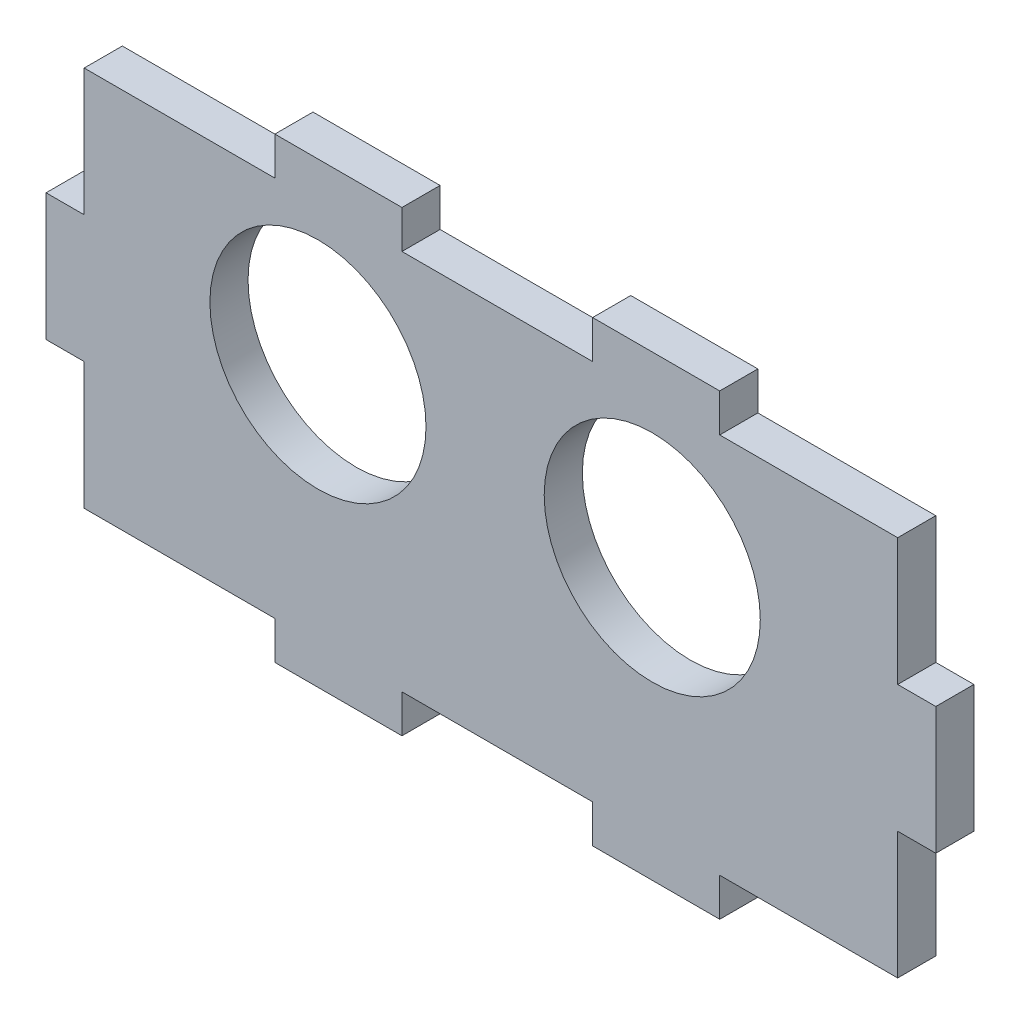
ISO-10303-21;
HEADER;
FILE_DESCRIPTION(('STEP AP214'),'2;1');
FILE_NAME('part.step','',(''),(''),'','','');
FILE_SCHEMA(('AUTOMOTIVE_DESIGN { 1 0 10303 214 1 1 1 1 }'));
ENDSEC;
DATA;
#1=APPLICATION_CONTEXT('core data for automotive mechanical design processes');
#2=APPLICATION_PROTOCOL_DEFINITION('international standard','automotive_design',2000,#1);
#3=PRODUCT_CONTEXT('',#1,'mechanical');
#4=PRODUCT('Part','Part','',(#3));
#5=PRODUCT_RELATED_PRODUCT_CATEGORY('part','',(#4));
#6=PRODUCT_DEFINITION_FORMATION('','',#4);
#7=PRODUCT_DEFINITION_CONTEXT('part definition',#1,'design');
#8=PRODUCT_DEFINITION('design','',#6,#7);
#9=PRODUCT_DEFINITION_SHAPE('','',#8);
#10=(LENGTH_UNIT() NAMED_UNIT(*) SI_UNIT(.MILLI.,.METRE.));
#11=(NAMED_UNIT(*) PLANE_ANGLE_UNIT() SI_UNIT($,.RADIAN.));
#12=(NAMED_UNIT(*) SI_UNIT($,.STERADIAN.) SOLID_ANGLE_UNIT());
#13=UNCERTAINTY_MEASURE_WITH_UNIT(LENGTH_MEASURE(1.E-05),#10,'distance_accuracy_value','');
#14=(GEOMETRIC_REPRESENTATION_CONTEXT(3) GLOBAL_UNCERTAINTY_ASSIGNED_CONTEXT((#13)) GLOBAL_UNIT_ASSIGNED_CONTEXT((#10,
#11,#12)) REPRESENTATION_CONTEXT('',''));
#15=CARTESIAN_POINT('',(0.,0.,0.));
#16=DIRECTION('',(0.,0.,1.));
#17=DIRECTION('',(1.,0.,0.));
#18=AXIS2_PLACEMENT_3D('',#15,#16,#17);
#19=CARTESIAN_POINT('',(0.,0.,3.));
#20=DIRECTION('',(0.,0.,-1.));
#21=DIRECTION('',(-1.,0.,0.));
#22=AXIS2_PLACEMENT_3D('',#19,#20,#21);
#23=PLANE('',#22);
#24=DIRECTION('',(0.,1.,0.));
#25=VECTOR('',#24,1.);
#26=CARTESIAN_POINT('',(11.0987610930498,-30.,3.));
#27=LINE('',#26,#25);
#28=CARTESIAN_POINT('',(11.0987610930498,-33.,3.));
#29=VERTEX_POINT('',#28);
#30=CARTESIAN_POINT('',(11.0987610930498,-30.,3.));
#31=VERTEX_POINT('',#30);
#32=EDGE_CURVE('E305',#29,#31,#27,.T.);
#33=ORIENTED_EDGE('',*,*,#32,.T.);
#34=DIRECTION('',(1.,0.,0.));
#35=VECTOR('',#34,1.);
#36=CARTESIAN_POINT('',(25.0987610930498,-30.,3.));
#37=LINE('',#36,#35);
#38=CARTESIAN_POINT('',(25.0987610930498,-30.,3.));
#39=VERTEX_POINT('',#38);
#40=EDGE_CURVE('E153',#31,#39,#37,.T.);
#41=ORIENTED_EDGE('',*,*,#40,.T.);
#42=DIRECTION('',(0.,1.,0.));
#43=VECTOR('',#42,1.);
#44=CARTESIAN_POINT('',(25.0987610930498,-20.,3.));
#45=LINE('',#44,#43);
#46=CARTESIAN_POINT('',(25.0987610930498,-20.,3.));
#47=VERTEX_POINT('',#46);
#48=EDGE_CURVE('E380',#39,#47,#45,.T.);
#49=ORIENTED_EDGE('',*,*,#48,.T.);
#50=DIRECTION('',(1.,0.,0.));
#51=VECTOR('',#50,1.);
#52=CARTESIAN_POINT('',(28.0987610930498,-20.,3.));
#53=LINE('',#52,#51);
#54=CARTESIAN_POINT('',(28.0987610930498,-20.,3.));
#55=VERTEX_POINT('',#54);
#56=EDGE_CURVE('E399',#47,#55,#53,.T.);
#57=ORIENTED_EDGE('',*,*,#56,.T.);
#58=DIRECTION('',(0.,1.,0.));
#59=VECTOR('',#58,1.);
#60=CARTESIAN_POINT('',(28.0987610930498,-10.,3.));
#61=LINE('',#60,#59);
#62=CARTESIAN_POINT('',(28.0987610930498,-10.,3.));
#63=VERTEX_POINT('',#62);
#64=EDGE_CURVE('E396',#55,#63,#61,.T.);
#65=ORIENTED_EDGE('',*,*,#64,.T.);
#66=DIRECTION('',(-1.,0.,0.));
#67=VECTOR('',#66,1.);
#68=CARTESIAN_POINT('',(25.0987610930498,-10.,3.));
#69=LINE('',#68,#67);
#70=CARTESIAN_POINT('',(25.0987610930498,-10.,3.));
#71=VERTEX_POINT('',#70);
#72=EDGE_CURVE('E398',#63,#71,#69,.T.);
#73=ORIENTED_EDGE('',*,*,#72,.T.);
#74=DIRECTION('',(0.,1.,0.));
#75=VECTOR('',#74,1.);
#76=CARTESIAN_POINT('',(25.0987610930498,0.,3.));
#77=LINE('',#76,#75);
#78=CARTESIAN_POINT('',(25.0987610930498,0.,3.));
#79=VERTEX_POINT('',#78);
#80=EDGE_CURVE('E401',#71,#79,#77,.T.);
#81=ORIENTED_EDGE('',*,*,#80,.T.);
#82=DIRECTION('',(-1.,0.,0.));
#83=VECTOR('',#82,1.);
#84=CARTESIAN_POINT('',(11.0987610930498,0.,3.));
#85=LINE('',#84,#83);
#86=CARTESIAN_POINT('',(11.0987610930498,0.,3.));
#87=VERTEX_POINT('',#86);
#88=EDGE_CURVE('E407',#79,#87,#85,.T.);
#89=ORIENTED_EDGE('',*,*,#88,.T.);
#90=DIRECTION('',(0.,1.,0.));
#91=VECTOR('',#90,1.);
#92=CARTESIAN_POINT('',(11.0987610930498,3.,3.));
#93=LINE('',#92,#91);
#94=CARTESIAN_POINT('',(11.0987610930498,3.,3.));
#95=VERTEX_POINT('',#94);
#96=EDGE_CURVE('E409',#87,#95,#93,.T.);
#97=ORIENTED_EDGE('',*,*,#96,.T.);
#98=DIRECTION('',(-1.,0.,0.));
#99=VECTOR('',#98,1.);
#100=CARTESIAN_POINT('',(1.09876109304978,3.,3.));
#101=LINE('',#100,#99);
#102=CARTESIAN_POINT('',(1.09876109304978,3.,3.));
#103=VERTEX_POINT('',#102);
#104=EDGE_CURVE('E411',#95,#103,#101,.T.);
#105=ORIENTED_EDGE('',*,*,#104,.T.);
#106=DIRECTION('',(0.,-1.,0.));
#107=VECTOR('',#106,1.);
#108=CARTESIAN_POINT('',(1.09876109304978,0.,3.));
#109=LINE('',#108,#107);
#110=CARTESIAN_POINT('',(1.09876109304978,0.,3.));
#111=VERTEX_POINT('',#110);
#112=EDGE_CURVE('E413',#103,#111,#109,.T.);
#113=ORIENTED_EDGE('',*,*,#112,.T.);
#114=DIRECTION('',(-1.,0.,0.));
#115=VECTOR('',#114,1.);
#116=CARTESIAN_POINT('',(-13.9012389069502,0.,3.));
#117=LINE('',#116,#115);
#118=CARTESIAN_POINT('',(-13.9012389069502,0.,3.));
#119=VERTEX_POINT('',#118);
#120=EDGE_CURVE('E415',#111,#119,#117,.T.);
#121=ORIENTED_EDGE('',*,*,#120,.T.);
#122=DIRECTION('',(0.,1.,0.));
#123=VECTOR('',#122,1.);
#124=CARTESIAN_POINT('',(-13.9012389069502,3.,3.));
#125=LINE('',#124,#123);
#126=CARTESIAN_POINT('',(-13.9012389069502,3.,3.));
#127=VERTEX_POINT('',#126);
#128=EDGE_CURVE('E417',#119,#127,#125,.T.);
#129=ORIENTED_EDGE('',*,*,#128,.T.);
#130=DIRECTION('',(-1.,0.,0.));
#131=VECTOR('',#130,1.);
#132=CARTESIAN_POINT('',(-23.9012389069502,3.,3.));
#133=LINE('',#132,#131);
#134=CARTESIAN_POINT('',(-23.9012389069502,3.,3.));
#135=VERTEX_POINT('',#134);
#136=EDGE_CURVE('E419',#127,#135,#133,.T.);
#137=ORIENTED_EDGE('',*,*,#136,.T.);
#138=DIRECTION('',(0.,-1.,0.));
#139=VECTOR('',#138,1.);
#140=CARTESIAN_POINT('',(-23.9012389069502,0.,3.));
#141=LINE('',#140,#139);
#142=CARTESIAN_POINT('',(-23.9012389069502,0.,3.));
#143=VERTEX_POINT('',#142);
#144=EDGE_CURVE('E421',#135,#143,#141,.T.);
#145=ORIENTED_EDGE('',*,*,#144,.T.);
#146=DIRECTION('',(-1.,0.,0.));
#147=VECTOR('',#146,1.);
#148=CARTESIAN_POINT('',(-38.9012389069502,0.,3.));
#149=LINE('',#148,#147);
#150=CARTESIAN_POINT('',(-38.9012389069502,0.,3.));
#151=VERTEX_POINT('',#150);
#152=EDGE_CURVE('E423',#143,#151,#149,.T.);
#153=ORIENTED_EDGE('',*,*,#152,.T.);
#154=DIRECTION('',(0.,-1.,0.));
#155=VECTOR('',#154,1.);
#156=CARTESIAN_POINT('',(-38.9012389069502,0.,3.));
#157=LINE('',#156,#155);
#158=CARTESIAN_POINT('',(-38.9012389069502,-10.,3.));
#159=VERTEX_POINT('',#158);
#160=EDGE_CURVE('E425',#151,#159,#157,.T.);
#161=ORIENTED_EDGE('',*,*,#160,.T.);
#162=DIRECTION('',(-1.,0.,0.));
#163=VECTOR('',#162,1.);
#164=CARTESIAN_POINT('',(-38.9012389069502,-10.,3.));
#165=LINE('',#164,#163);
#166=CARTESIAN_POINT('',(-41.9012389069502,-10.,3.));
#167=VERTEX_POINT('',#166);
#168=EDGE_CURVE('E427',#159,#167,#165,.T.);
#169=ORIENTED_EDGE('',*,*,#168,.T.);
#170=DIRECTION('',(0.,-1.,0.));
#171=VECTOR('',#170,1.);
#172=CARTESIAN_POINT('',(-41.9012389069502,-10.,3.));
#173=LINE('',#172,#171);
#174=CARTESIAN_POINT('',(-41.9012389069502,-20.,3.));
#175=VERTEX_POINT('',#174);
#176=EDGE_CURVE('E429',#167,#175,#173,.T.);
#177=ORIENTED_EDGE('',*,*,#176,.T.);
#178=DIRECTION('',(1.,0.,0.));
#179=VECTOR('',#178,1.);
#180=CARTESIAN_POINT('',(-41.9012389069502,-20.,3.));
#181=LINE('',#180,#179);
#182=CARTESIAN_POINT('',(-38.9012389069502,-20.,3.));
#183=VERTEX_POINT('',#182);
#184=EDGE_CURVE('E431',#175,#183,#181,.T.);
#185=ORIENTED_EDGE('',*,*,#184,.T.);
#186=DIRECTION('',(0.,-1.,0.));
#187=VECTOR('',#186,1.);
#188=CARTESIAN_POINT('',(-38.9012389069502,-20.,3.));
#189=LINE('',#188,#187);
#190=CARTESIAN_POINT('',(-38.9012389069502,-30.,3.));
#191=VERTEX_POINT('',#190);
#192=EDGE_CURVE('E433',#183,#191,#189,.T.);
#193=ORIENTED_EDGE('',*,*,#192,.T.);
#194=DIRECTION('',(1.,0.,0.));
#195=VECTOR('',#194,1.);
#196=CARTESIAN_POINT('',(-23.9012389069502,-30.,3.));
#197=LINE('',#196,#195);
#198=CARTESIAN_POINT('',(-23.9012389069502,-30.,3.));
#199=VERTEX_POINT('',#198);
#200=EDGE_CURVE('E435',#191,#199,#197,.T.);
#201=ORIENTED_EDGE('',*,*,#200,.T.);
#202=DIRECTION('',(0.,-1.,0.));
#203=VECTOR('',#202,1.);
#204=CARTESIAN_POINT('',(-23.9012389069502,-33.,3.));
#205=LINE('',#204,#203);
#206=CARTESIAN_POINT('',(-23.9012389069502,-33.,3.));
#207=VERTEX_POINT('',#206);
#208=EDGE_CURVE('E437',#199,#207,#205,.T.);
#209=ORIENTED_EDGE('',*,*,#208,.T.);
#210=DIRECTION('',(1.,0.,0.));
#211=VECTOR('',#210,1.);
#212=CARTESIAN_POINT('',(-13.9012389069502,-33.,3.));
#213=LINE('',#212,#211);
#214=CARTESIAN_POINT('',(-13.9012389069502,-33.,3.));
#215=VERTEX_POINT('',#214);
#216=EDGE_CURVE('E439',#207,#215,#213,.T.);
#217=ORIENTED_EDGE('',*,*,#216,.T.);
#218=DIRECTION('',(0.,1.,0.));
#219=VECTOR('',#218,1.);
#220=CARTESIAN_POINT('',(-13.9012389069502,-30.,3.));
#221=LINE('',#220,#219);
#222=CARTESIAN_POINT('',(-13.9012389069502,-30.,3.));
#223=VERTEX_POINT('',#222);
#224=EDGE_CURVE('E232',#215,#223,#221,.T.);
#225=ORIENTED_EDGE('',*,*,#224,.T.);
#226=DIRECTION('',(1.,0.,0.));
#227=VECTOR('',#226,1.);
#228=CARTESIAN_POINT('',(1.0987610930498,-30.,3.));
#229=LINE('',#228,#227);
#230=CARTESIAN_POINT('',(1.0987610930498,-30.,3.));
#231=VERTEX_POINT('',#230);
#232=EDGE_CURVE('E226',#223,#231,#229,.T.);
#233=ORIENTED_EDGE('',*,*,#232,.T.);
#234=DIRECTION('',(0.,-1.,0.));
#235=VECTOR('',#234,1.);
#236=CARTESIAN_POINT('',(1.0987610930498,-33.,3.));
#237=LINE('',#236,#235);
#238=CARTESIAN_POINT('',(1.0987610930498,-33.,3.));
#239=VERTEX_POINT('',#238);
#240=EDGE_CURVE('E230',#231,#239,#237,.T.);
#241=ORIENTED_EDGE('',*,*,#240,.T.);
#242=DIRECTION('',(1.,0.,0.));
#243=VECTOR('',#242,1.);
#244=CARTESIAN_POINT('',(11.0987610930498,-33.,3.));
#245=LINE('',#244,#243);
#246=EDGE_CURVE('E50',#239,#29,#245,.T.);
#247=ORIENTED_EDGE('',*,*,#246,.T.);
#248=EDGE_LOOP('',(#33,#41,#49,#57,#65,#73,#81,#89,#97,#105,#113,#121,#129,#137,#145,#153,#161,
#169,#177,#185,#193,#201,#209,#217,#225,#233,#241,#247));
#249=FACE_BOUND('',#248,.T.);
#250=CARTESIAN_POINT('',(-20.510522939361,-11.,3.));
#251=DIRECTION('',(0.,0.,1.));
#252=DIRECTION('',(1.,0.,0.));
#253=AXIS2_PLACEMENT_3D('',#250,#251,#252);
#254=CIRCLE('',#253,8.5);
#255=CARTESIAN_POINT('',(-12.010522939361,-11.,3.));
#256=VERTEX_POINT('',#255);
#257=EDGE_CURVE('E254',#256,#256,#254,.T.);
#258=ORIENTED_EDGE('',*,*,#257,.F.);
#259=EDGE_LOOP('',(#258));
#260=FACE_BOUND('',#259,.T.);
#261=CARTESIAN_POINT('',(5.78947706063905,-11.,3.));
#262=DIRECTION('',(0.,0.,1.));
#263=DIRECTION('',(1.,0.,0.));
#264=AXIS2_PLACEMENT_3D('',#261,#262,#263);
#265=CIRCLE('',#264,8.5);
#266=CARTESIAN_POINT('',(14.289477060639,-11.,3.));
#267=VERTEX_POINT('',#266);
#268=EDGE_CURVE('E480',#267,#267,#265,.T.);
#269=ORIENTED_EDGE('',*,*,#268,.F.);
#270=EDGE_LOOP('',(#269));
#271=FACE_BOUND('',#270,.T.);
#272=ADVANCED_FACE('F33',(#249,#260,#271),#23,.F.);
#273=CARTESIAN_POINT('',(0.,0.,0.));
#274=DIRECTION('',(0.,0.,-1.));
#275=DIRECTION('',(-1.,0.,0.));
#276=AXIS2_PLACEMENT_3D('',#273,#274,#275);
#277=PLANE('',#276);
#278=CARTESIAN_POINT('',(-20.510522939361,-11.,0.));
#279=DIRECTION('',(0.,0.,1.));
#280=DIRECTION('',(1.,0.,0.));
#281=AXIS2_PLACEMENT_3D('',#278,#279,#280);
#282=CIRCLE('',#281,8.5);
#283=CARTESIAN_POINT('',(-12.010522939361,-11.,0.));
#284=VERTEX_POINT('',#283);
#285=EDGE_CURVE('E485',#284,#284,#282,.T.);
#286=ORIENTED_EDGE('',*,*,#285,.T.);
#287=EDGE_LOOP('',(#286));
#288=FACE_BOUND('',#287,.T.);
#289=DIRECTION('',(0.,1.,0.));
#290=VECTOR('',#289,1.);
#291=CARTESIAN_POINT('',(11.0987610930498,-30.,0.));
#292=LINE('',#291,#290);
#293=CARTESIAN_POINT('',(11.0987610930498,-33.,0.));
#294=VERTEX_POINT('',#293);
#295=CARTESIAN_POINT('',(11.0987610930498,-30.,0.));
#296=VERTEX_POINT('',#295);
#297=EDGE_CURVE('E250',#294,#296,#292,.T.);
#298=ORIENTED_EDGE('',*,*,#297,.F.);
#299=DIRECTION('',(1.,0.,0.));
#300=VECTOR('',#299,1.);
#301=CARTESIAN_POINT('',(11.0987610930498,-33.,0.));
#302=LINE('',#301,#300);
#303=CARTESIAN_POINT('',(1.0987610930498,-33.,0.));
#304=VERTEX_POINT('',#303);
#305=EDGE_CURVE('E145',#304,#294,#302,.T.);
#306=ORIENTED_EDGE('',*,*,#305,.F.);
#307=DIRECTION('',(0.,-1.,0.));
#308=VECTOR('',#307,1.);
#309=CARTESIAN_POINT('',(1.0987610930498,-33.,0.));
#310=LINE('',#309,#308);
#311=CARTESIAN_POINT('',(1.0987610930498,-30.,0.));
#312=VERTEX_POINT('',#311);
#313=EDGE_CURVE('E139',#312,#304,#310,.T.);
#314=ORIENTED_EDGE('',*,*,#313,.F.);
#315=DIRECTION('',(1.,0.,0.));
#316=VECTOR('',#315,1.);
#317=CARTESIAN_POINT('',(1.0987610930498,-30.,0.));
#318=LINE('',#317,#316);
#319=CARTESIAN_POINT('',(-13.9012389069502,-30.,0.));
#320=VERTEX_POINT('',#319);
#321=EDGE_CURVE('E240',#320,#312,#318,.T.);
#322=ORIENTED_EDGE('',*,*,#321,.F.);
#323=DIRECTION('',(0.,1.,0.));
#324=VECTOR('',#323,1.);
#325=CARTESIAN_POINT('',(-13.9012389069502,-30.,0.));
#326=LINE('',#325,#324);
#327=CARTESIAN_POINT('',(-13.9012389069502,-33.,0.));
#328=VERTEX_POINT('',#327);
#329=EDGE_CURVE('E300',#328,#320,#326,.T.);
#330=ORIENTED_EDGE('',*,*,#329,.F.);
#331=DIRECTION('',(1.,0.,0.));
#332=VECTOR('',#331,1.);
#333=CARTESIAN_POINT('',(-13.9012389069502,-33.,0.));
#334=LINE('',#333,#332);
#335=CARTESIAN_POINT('',(-23.9012389069502,-33.,0.));
#336=VERTEX_POINT('',#335);
#337=EDGE_CURVE('E298',#336,#328,#334,.T.);
#338=ORIENTED_EDGE('',*,*,#337,.F.);
#339=DIRECTION('',(0.,-1.,0.));
#340=VECTOR('',#339,1.);
#341=CARTESIAN_POINT('',(-23.9012389069502,-33.,0.));
#342=LINE('',#341,#340);
#343=CARTESIAN_POINT('',(-23.9012389069502,-30.,0.));
#344=VERTEX_POINT('',#343);
#345=EDGE_CURVE('E296',#344,#336,#342,.T.);
#346=ORIENTED_EDGE('',*,*,#345,.F.);
#347=DIRECTION('',(1.,0.,0.));
#348=VECTOR('',#347,1.);
#349=CARTESIAN_POINT('',(-23.9012389069502,-30.,0.));
#350=LINE('',#349,#348);
#351=CARTESIAN_POINT('',(-38.9012389069502,-30.,0.));
#352=VERTEX_POINT('',#351);
#353=EDGE_CURVE('E294',#352,#344,#350,.T.);
#354=ORIENTED_EDGE('',*,*,#353,.F.);
#355=DIRECTION('',(0.,-1.,0.));
#356=VECTOR('',#355,1.);
#357=CARTESIAN_POINT('',(-38.9012389069502,-20.,0.));
#358=LINE('',#357,#356);
#359=CARTESIAN_POINT('',(-38.9012389069502,-20.,0.));
#360=VERTEX_POINT('',#359);
#361=EDGE_CURVE('E292',#360,#352,#358,.T.);
#362=ORIENTED_EDGE('',*,*,#361,.F.);
#363=DIRECTION('',(1.,0.,0.));
#364=VECTOR('',#363,1.);
#365=CARTESIAN_POINT('',(-41.9012389069502,-20.,0.));
#366=LINE('',#365,#364);
#367=CARTESIAN_POINT('',(-41.9012389069502,-20.,0.));
#368=VERTEX_POINT('',#367);
#369=EDGE_CURVE('E290',#368,#360,#366,.T.);
#370=ORIENTED_EDGE('',*,*,#369,.F.);
#371=DIRECTION('',(0.,-1.,0.));
#372=VECTOR('',#371,1.);
#373=CARTESIAN_POINT('',(-41.9012389069502,-10.,0.));
#374=LINE('',#373,#372);
#375=CARTESIAN_POINT('',(-41.9012389069502,-10.,0.));
#376=VERTEX_POINT('',#375);
#377=EDGE_CURVE('E288',#376,#368,#374,.T.);
#378=ORIENTED_EDGE('',*,*,#377,.F.);
#379=DIRECTION('',(-1.,0.,0.));
#380=VECTOR('',#379,1.);
#381=CARTESIAN_POINT('',(-38.9012389069502,-10.,0.));
#382=LINE('',#381,#380);
#383=CARTESIAN_POINT('',(-38.9012389069502,-10.,0.));
#384=VERTEX_POINT('',#383);
#385=EDGE_CURVE('E286',#384,#376,#382,.T.);
#386=ORIENTED_EDGE('',*,*,#385,.F.);
#387=DIRECTION('',(0.,-1.,0.));
#388=VECTOR('',#387,1.);
#389=CARTESIAN_POINT('',(-38.9012389069502,0.,0.));
#390=LINE('',#389,#388);
#391=CARTESIAN_POINT('',(-38.9012389069502,0.,0.));
#392=VERTEX_POINT('',#391);
#393=EDGE_CURVE('E284',#392,#384,#390,.T.);
#394=ORIENTED_EDGE('',*,*,#393,.F.);
#395=DIRECTION('',(-1.,0.,0.));
#396=VECTOR('',#395,1.);
#397=CARTESIAN_POINT('',(-38.9012389069502,0.,0.));
#398=LINE('',#397,#396);
#399=CARTESIAN_POINT('',(-23.9012389069502,0.,0.));
#400=VERTEX_POINT('',#399);
#401=EDGE_CURVE('E282',#400,#392,#398,.T.);
#402=ORIENTED_EDGE('',*,*,#401,.F.);
#403=DIRECTION('',(0.,-1.,0.));
#404=VECTOR('',#403,1.);
#405=CARTESIAN_POINT('',(-23.9012389069502,0.,0.));
#406=LINE('',#405,#404);
#407=CARTESIAN_POINT('',(-23.9012389069502,3.,0.));
#408=VERTEX_POINT('',#407);
#409=EDGE_CURVE('E280',#408,#400,#406,.T.);
#410=ORIENTED_EDGE('',*,*,#409,.F.);
#411=DIRECTION('',(-1.,0.,0.));
#412=VECTOR('',#411,1.);
#413=CARTESIAN_POINT('',(-23.9012389069502,3.,0.));
#414=LINE('',#413,#412);
#415=CARTESIAN_POINT('',(-13.9012389069502,3.,0.));
#416=VERTEX_POINT('',#415);
#417=EDGE_CURVE('E278',#416,#408,#414,.T.);
#418=ORIENTED_EDGE('',*,*,#417,.F.);
#419=DIRECTION('',(0.,1.,0.));
#420=VECTOR('',#419,1.);
#421=CARTESIAN_POINT('',(-13.9012389069502,3.,0.));
#422=LINE('',#421,#420);
#423=CARTESIAN_POINT('',(-13.9012389069502,0.,0.));
#424=VERTEX_POINT('',#423);
#425=EDGE_CURVE('E276',#424,#416,#422,.T.);
#426=ORIENTED_EDGE('',*,*,#425,.F.);
#427=DIRECTION('',(-1.,0.,0.));
#428=VECTOR('',#427,1.);
#429=CARTESIAN_POINT('',(-13.9012389069502,0.,0.));
#430=LINE('',#429,#428);
#431=CARTESIAN_POINT('',(1.09876109304978,0.,0.));
#432=VERTEX_POINT('',#431);
#433=EDGE_CURVE('E274',#432,#424,#430,.T.);
#434=ORIENTED_EDGE('',*,*,#433,.F.);
#435=DIRECTION('',(0.,-1.,0.));
#436=VECTOR('',#435,1.);
#437=CARTESIAN_POINT('',(1.09876109304978,0.,0.));
#438=LINE('',#437,#436);
#439=CARTESIAN_POINT('',(1.09876109304978,3.,0.));
#440=VERTEX_POINT('',#439);
#441=EDGE_CURVE('E272',#440,#432,#438,.T.);
#442=ORIENTED_EDGE('',*,*,#441,.F.);
#443=DIRECTION('',(-1.,0.,0.));
#444=VECTOR('',#443,1.);
#445=CARTESIAN_POINT('',(1.09876109304978,3.,0.));
#446=LINE('',#445,#444);
#447=CARTESIAN_POINT('',(11.0987610930498,3.,0.));
#448=VERTEX_POINT('',#447);
#449=EDGE_CURVE('E270',#448,#440,#446,.T.);
#450=ORIENTED_EDGE('',*,*,#449,.F.);
#451=DIRECTION('',(0.,1.,0.));
#452=VECTOR('',#451,1.);
#453=CARTESIAN_POINT('',(11.0987610930498,3.,0.));
#454=LINE('',#453,#452);
#455=CARTESIAN_POINT('',(11.0987610930498,0.,0.));
#456=VERTEX_POINT('',#455);
#457=EDGE_CURVE('E268',#456,#448,#454,.T.);
#458=ORIENTED_EDGE('',*,*,#457,.F.);
#459=DIRECTION('',(-1.,0.,0.));
#460=VECTOR('',#459,1.);
#461=CARTESIAN_POINT('',(11.0987610930498,0.,0.));
#462=LINE('',#461,#460);
#463=CARTESIAN_POINT('',(25.0987610930498,0.,0.));
#464=VERTEX_POINT('',#463);
#465=EDGE_CURVE('E266',#464,#456,#462,.T.);
#466=ORIENTED_EDGE('',*,*,#465,.F.);
#467=DIRECTION('',(0.,1.,0.));
#468=VECTOR('',#467,1.);
#469=CARTESIAN_POINT('',(25.0987610930498,0.,0.));
#470=LINE('',#469,#468);
#471=CARTESIAN_POINT('',(25.0987610930498,-10.,0.));
#472=VERTEX_POINT('',#471);
#473=EDGE_CURVE('E264',#472,#464,#470,.T.);
#474=ORIENTED_EDGE('',*,*,#473,.F.);
#475=DIRECTION('',(-1.,0.,0.));
#476=VECTOR('',#475,1.);
#477=CARTESIAN_POINT('',(25.0987610930498,-10.,0.));
#478=LINE('',#477,#476);
#479=CARTESIAN_POINT('',(28.0987610930498,-10.,0.));
#480=VERTEX_POINT('',#479);
#481=EDGE_CURVE('E262',#480,#472,#478,.T.);
#482=ORIENTED_EDGE('',*,*,#481,.F.);
#483=DIRECTION('',(0.,1.,0.));
#484=VECTOR('',#483,1.);
#485=CARTESIAN_POINT('',(28.0987610930498,-10.,0.));
#486=LINE('',#485,#484);
#487=CARTESIAN_POINT('',(28.0987610930498,-20.,0.));
#488=VERTEX_POINT('',#487);
#489=EDGE_CURVE('E260',#488,#480,#486,.T.);
#490=ORIENTED_EDGE('',*,*,#489,.F.);
#491=DIRECTION('',(1.,0.,0.));
#492=VECTOR('',#491,1.);
#493=CARTESIAN_POINT('',(28.0987610930498,-20.,0.));
#494=LINE('',#493,#492);
#495=CARTESIAN_POINT('',(25.0987610930498,-20.,0.));
#496=VERTEX_POINT('',#495);
#497=EDGE_CURVE('E258',#496,#488,#494,.T.);
#498=ORIENTED_EDGE('',*,*,#497,.F.);
#499=DIRECTION('',(0.,1.,0.));
#500=VECTOR('',#499,1.);
#501=CARTESIAN_POINT('',(25.0987610930498,-20.,0.));
#502=LINE('',#501,#500);
#503=CARTESIAN_POINT('',(25.0987610930498,-30.,0.));
#504=VERTEX_POINT('',#503);
#505=EDGE_CURVE('E256',#504,#496,#502,.T.);
#506=ORIENTED_EDGE('',*,*,#505,.F.);
#507=DIRECTION('',(1.,0.,0.));
#508=VECTOR('',#507,1.);
#509=CARTESIAN_POINT('',(25.0987610930498,-30.,0.));
#510=LINE('',#509,#508);
#511=EDGE_CURVE('E253',#296,#504,#510,.T.);
#512=ORIENTED_EDGE('',*,*,#511,.F.);
#513=EDGE_LOOP('',(#298,#306,#314,#322,#330,#338,#346,#354,#362,#370,#378,#386,#394,#402,#410,
#418,#426,#434,#442,#450,#458,#466,#474,#482,#490,#498,#506,#512));
#514=FACE_BOUND('',#513,.T.);
#515=CARTESIAN_POINT('',(5.78947706063905,-11.,0.));
#516=DIRECTION('',(0.,0.,1.));
#517=DIRECTION('',(1.,0.,0.));
#518=AXIS2_PLACEMENT_3D('',#515,#516,#517);
#519=CIRCLE('',#518,8.5);
#520=CARTESIAN_POINT('',(14.289477060639,-11.,0.));
#521=VERTEX_POINT('',#520);
#522=EDGE_CURVE('E483',#521,#521,#519,.T.);
#523=ORIENTED_EDGE('',*,*,#522,.T.);
#524=EDGE_LOOP('',(#523));
#525=FACE_BOUND('',#524,.T.);
#526=ADVANCED_FACE('F384',(#288,#514,#525),#277,.T.);
#527=CARTESIAN_POINT('',(11.0987610930498,-30.,3.));
#528=DIRECTION('',(-1.,0.,0.));
#529=DIRECTION('',(0.,-1.,0.));
#530=AXIS2_PLACEMENT_3D('',#527,#528,#529);
#531=PLANE('',#530);
#532=ORIENTED_EDGE('',*,*,#297,.T.);
#533=DIRECTION('',(0.,0.,-1.));
#534=VECTOR('',#533,1.);
#535=CARTESIAN_POINT('',(11.0987610930498,-30.,3.));
#536=LINE('',#535,#534);
#537=EDGE_CURVE('E11',#31,#296,#536,.T.);
#538=ORIENTED_EDGE('',*,*,#537,.F.);
#539=ORIENTED_EDGE('',*,*,#32,.F.);
#540=DIRECTION('',(0.,0.,-1.));
#541=VECTOR('',#540,1.);
#542=CARTESIAN_POINT('',(11.0987610930498,-33.,3.));
#543=LINE('',#542,#541);
#544=EDGE_CURVE('E246',#29,#294,#543,.T.);
#545=ORIENTED_EDGE('',*,*,#544,.T.);
#546=EDGE_LOOP('',(#532,#538,#539,#545));
#547=FACE_BOUND('',#546,.T.);
#548=ADVANCED_FACE('F35',(#547),#531,.F.);
#549=CARTESIAN_POINT('',(25.0987610930498,-30.,3.));
#550=DIRECTION('',(0.,1.,0.));
#551=DIRECTION('',(0.,0.,1.));
#552=AXIS2_PLACEMENT_3D('',#549,#550,#551);
#553=PLANE('',#552);
#554=ORIENTED_EDGE('',*,*,#511,.T.);
#555=DIRECTION('',(0.,0.,-1.));
#556=VECTOR('',#555,1.);
#557=CARTESIAN_POINT('',(25.0987610930498,-30.,3.));
#558=LINE('',#557,#556);
#559=EDGE_CURVE('E42',#39,#504,#558,.T.);
#560=ORIENTED_EDGE('',*,*,#559,.F.);
#561=ORIENTED_EDGE('',*,*,#40,.F.);
#562=ORIENTED_EDGE('',*,*,#537,.T.);
#563=EDGE_LOOP('',(#554,#560,#561,#562));
#564=FACE_BOUND('',#563,.T.);
#565=ADVANCED_FACE('F740',(#564),#553,.F.);
#566=CARTESIAN_POINT('',(25.0987610930498,-20.,3.));
#567=DIRECTION('',(-1.,0.,0.));
#568=DIRECTION('',(0.,-1.,0.));
#569=AXIS2_PLACEMENT_3D('',#566,#567,#568);
#570=PLANE('',#569);
#571=ORIENTED_EDGE('',*,*,#505,.T.);
#572=DIRECTION('',(0.,0.,-1.));
#573=VECTOR('',#572,1.);
#574=CARTESIAN_POINT('',(25.0987610930498,-20.,3.));
#575=LINE('',#574,#573);
#576=EDGE_CURVE('E372',#47,#496,#575,.T.);
#577=ORIENTED_EDGE('',*,*,#576,.F.);
#578=ORIENTED_EDGE('',*,*,#48,.F.);
#579=ORIENTED_EDGE('',*,*,#559,.T.);
#580=EDGE_LOOP('',(#571,#577,#578,#579));
#581=FACE_BOUND('',#580,.T.);
#582=ADVANCED_FACE('F378',(#581),#570,.F.);
#583=CARTESIAN_POINT('',(28.0987610930498,-20.,3.));
#584=DIRECTION('',(0.,1.,0.));
#585=DIRECTION('',(0.,0.,1.));
#586=AXIS2_PLACEMENT_3D('',#583,#584,#585);
#587=PLANE('',#586);
#588=ORIENTED_EDGE('',*,*,#497,.T.);
#589=DIRECTION('',(0.,0.,-1.));
#590=VECTOR('',#589,1.);
#591=CARTESIAN_POINT('',(28.0987610930498,-20.,3.));
#592=LINE('',#591,#590);
#593=EDGE_CURVE('E369',#55,#488,#592,.T.);
#594=ORIENTED_EDGE('',*,*,#593,.F.);
#595=ORIENTED_EDGE('',*,*,#56,.F.);
#596=ORIENTED_EDGE('',*,*,#576,.T.);
#597=EDGE_LOOP('',(#588,#594,#595,#596));
#598=FACE_BOUND('',#597,.T.);
#599=ADVANCED_FACE('F390',(#598),#587,.F.);
#600=CARTESIAN_POINT('',(28.0987610930498,-10.,3.));
#601=DIRECTION('',(-1.,0.,0.));
#602=DIRECTION('',(0.,-1.,0.));
#603=AXIS2_PLACEMENT_3D('',#600,#601,#602);
#604=PLANE('',#603);
#605=ORIENTED_EDGE('',*,*,#489,.T.);
#606=DIRECTION('',(0.,0.,-1.));
#607=VECTOR('',#606,1.);
#608=CARTESIAN_POINT('',(28.0987610930498,-10.,3.));
#609=LINE('',#608,#607);
#610=EDGE_CURVE('E366',#63,#480,#609,.T.);
#611=ORIENTED_EDGE('',*,*,#610,.F.);
#612=ORIENTED_EDGE('',*,*,#64,.F.);
#613=ORIENTED_EDGE('',*,*,#593,.T.);
#614=EDGE_LOOP('',(#605,#611,#612,#613));
#615=FACE_BOUND('',#614,.T.);
#616=ADVANCED_FACE('F394',(#615),#604,.F.);
#617=CARTESIAN_POINT('',(25.0987610930498,-10.,3.));
#618=DIRECTION('',(0.,-1.,0.));
#619=DIRECTION('',(0.,0.,-1.));
#620=AXIS2_PLACEMENT_3D('',#617,#618,#619);
#621=PLANE('',#620);
#622=ORIENTED_EDGE('',*,*,#481,.T.);
#623=DIRECTION('',(0.,0.,-1.));
#624=VECTOR('',#623,1.);
#625=CARTESIAN_POINT('',(25.0987610930498,-10.,3.));
#626=LINE('',#625,#624);
#627=EDGE_CURVE('E363',#71,#472,#626,.T.);
#628=ORIENTED_EDGE('',*,*,#627,.F.);
#629=ORIENTED_EDGE('',*,*,#72,.F.);
#630=ORIENTED_EDGE('',*,*,#610,.T.);
#631=EDGE_LOOP('',(#622,#628,#629,#630));
#632=FACE_BOUND('',#631,.T.);
#633=ADVANCED_FACE('F705',(#632),#621,.F.);
#634=CARTESIAN_POINT('',(25.0987610930498,0.,3.));
#635=DIRECTION('',(-1.,0.,0.));
#636=DIRECTION('',(0.,0.,1.));
#637=AXIS2_PLACEMENT_3D('',#634,#635,#636);
#638=PLANE('',#637);
#639=ORIENTED_EDGE('',*,*,#473,.T.);
#640=DIRECTION('',(0.,0.,-1.));
#641=VECTOR('',#640,1.);
#642=CARTESIAN_POINT('',(25.0987610930498,0.,3.));
#643=LINE('',#642,#641);
#644=EDGE_CURVE('E360',#79,#464,#643,.T.);
#645=ORIENTED_EDGE('',*,*,#644,.F.);
#646=ORIENTED_EDGE('',*,*,#80,.F.);
#647=ORIENTED_EDGE('',*,*,#627,.T.);
#648=EDGE_LOOP('',(#639,#645,#646,#647));
#649=FACE_BOUND('',#648,.T.);
#650=ADVANCED_FACE('F695',(#649),#638,.F.);
#651=CARTESIAN_POINT('',(11.0987610930498,0.,3.));
#652=DIRECTION('',(0.,-1.,0.));
#653=DIRECTION('',(1.,0.,0.));
#654=AXIS2_PLACEMENT_3D('',#651,#652,#653);
#655=PLANE('',#654);
#656=ORIENTED_EDGE('',*,*,#465,.T.);
#657=DIRECTION('',(0.,0.,-1.));
#658=VECTOR('',#657,1.);
#659=CARTESIAN_POINT('',(11.0987610930498,0.,3.));
#660=LINE('',#659,#658);
#661=EDGE_CURVE('E357',#87,#456,#660,.T.);
#662=ORIENTED_EDGE('',*,*,#661,.F.);
#663=ORIENTED_EDGE('',*,*,#88,.F.);
#664=ORIENTED_EDGE('',*,*,#644,.T.);
#665=EDGE_LOOP('',(#656,#662,#663,#664));
#666=FACE_BOUND('',#665,.T.);
#667=ADVANCED_FACE('F685',(#666),#655,.F.);
#668=CARTESIAN_POINT('',(11.0987610930498,3.,3.));
#669=DIRECTION('',(-1.,0.,0.));
#670=DIRECTION('',(0.,-1.,0.));
#671=AXIS2_PLACEMENT_3D('',#668,#669,#670);
#672=PLANE('',#671);
#673=ORIENTED_EDGE('',*,*,#457,.T.);
#674=DIRECTION('',(0.,0.,-1.));
#675=VECTOR('',#674,1.);
#676=CARTESIAN_POINT('',(11.0987610930498,3.,3.));
#677=LINE('',#676,#675);
#678=EDGE_CURVE('E354',#95,#448,#677,.T.);
#679=ORIENTED_EDGE('',*,*,#678,.F.);
#680=ORIENTED_EDGE('',*,*,#96,.F.);
#681=ORIENTED_EDGE('',*,*,#661,.T.);
#682=EDGE_LOOP('',(#673,#679,#680,#681));
#683=FACE_BOUND('',#682,.T.);
#684=ADVANCED_FACE('F675',(#683),#672,.F.);
#685=CARTESIAN_POINT('',(1.09876109304978,3.,3.));
#686=DIRECTION('',(0.,-1.,0.));
#687=DIRECTION('',(0.,0.,-1.));
#688=AXIS2_PLACEMENT_3D('',#685,#686,#687);
#689=PLANE('',#688);
#690=ORIENTED_EDGE('',*,*,#449,.T.);
#691=DIRECTION('',(0.,0.,-1.));
#692=VECTOR('',#691,1.);
#693=CARTESIAN_POINT('',(1.09876109304978,3.,3.));
#694=LINE('',#693,#692);
#695=EDGE_CURVE('E351',#103,#440,#694,.T.);
#696=ORIENTED_EDGE('',*,*,#695,.F.);
#697=ORIENTED_EDGE('',*,*,#104,.F.);
#698=ORIENTED_EDGE('',*,*,#678,.T.);
#699=EDGE_LOOP('',(#690,#696,#697,#698));
#700=FACE_BOUND('',#699,.T.);
#701=ADVANCED_FACE('F665',(#700),#689,.F.);
#702=CARTESIAN_POINT('',(1.09876109304978,0.,3.));
#703=DIRECTION('',(1.,0.,0.));
#704=DIRECTION('',(0.,0.,-1.));
#705=AXIS2_PLACEMENT_3D('',#702,#703,#704);
#706=PLANE('',#705);
#707=ORIENTED_EDGE('',*,*,#441,.T.);
#708=DIRECTION('',(0.,0.,-1.));
#709=VECTOR('',#708,1.);
#710=CARTESIAN_POINT('',(1.09876109304978,0.,3.));
#711=LINE('',#710,#709);
#712=EDGE_CURVE('E348',#111,#432,#711,.T.);
#713=ORIENTED_EDGE('',*,*,#712,.F.);
#714=ORIENTED_EDGE('',*,*,#112,.F.);
#715=ORIENTED_EDGE('',*,*,#695,.T.);
#716=EDGE_LOOP('',(#707,#713,#714,#715));
#717=FACE_BOUND('',#716,.T.);
#718=ADVANCED_FACE('F655',(#717),#706,.F.);
#719=CARTESIAN_POINT('',(-13.9012389069502,0.,3.));
#720=DIRECTION('',(0.,-1.,0.));
#721=DIRECTION('',(0.,0.,-1.));
#722=AXIS2_PLACEMENT_3D('',#719,#720,#721);
#723=PLANE('',#722);
#724=ORIENTED_EDGE('',*,*,#433,.T.);
#725=DIRECTION('',(0.,0.,-1.));
#726=VECTOR('',#725,1.);
#727=CARTESIAN_POINT('',(-13.9012389069502,0.,3.));
#728=LINE('',#727,#726);
#729=EDGE_CURVE('E345',#119,#424,#728,.T.);
#730=ORIENTED_EDGE('',*,*,#729,.F.);
#731=ORIENTED_EDGE('',*,*,#120,.F.);
#732=ORIENTED_EDGE('',*,*,#712,.T.);
#733=EDGE_LOOP('',(#724,#730,#731,#732));
#734=FACE_BOUND('',#733,.T.);
#735=ADVANCED_FACE('F645',(#734),#723,.F.);
#736=CARTESIAN_POINT('',(-13.9012389069502,3.,3.));
#737=DIRECTION('',(-1.,0.,0.));
#738=DIRECTION('',(0.,-1.,0.));
#739=AXIS2_PLACEMENT_3D('',#736,#737,#738);
#740=PLANE('',#739);
#741=ORIENTED_EDGE('',*,*,#425,.T.);
#742=DIRECTION('',(0.,0.,-1.));
#743=VECTOR('',#742,1.);
#744=CARTESIAN_POINT('',(-13.9012389069502,3.,3.));
#745=LINE('',#744,#743);
#746=EDGE_CURVE('E342',#127,#416,#745,.T.);
#747=ORIENTED_EDGE('',*,*,#746,.F.);
#748=ORIENTED_EDGE('',*,*,#128,.F.);
#749=ORIENTED_EDGE('',*,*,#729,.T.);
#750=EDGE_LOOP('',(#741,#747,#748,#749));
#751=FACE_BOUND('',#750,.T.);
#752=ADVANCED_FACE('F635',(#751),#740,.F.);
#753=CARTESIAN_POINT('',(-23.9012389069502,3.,3.));
#754=DIRECTION('',(0.,-1.,0.));
#755=DIRECTION('',(0.,0.,-1.));
#756=AXIS2_PLACEMENT_3D('',#753,#754,#755);
#757=PLANE('',#756);
#758=ORIENTED_EDGE('',*,*,#417,.T.);
#759=DIRECTION('',(0.,0.,-1.));
#760=VECTOR('',#759,1.);
#761=CARTESIAN_POINT('',(-23.9012389069502,3.,3.));
#762=LINE('',#761,#760);
#763=EDGE_CURVE('E339',#135,#408,#762,.T.);
#764=ORIENTED_EDGE('',*,*,#763,.F.);
#765=ORIENTED_EDGE('',*,*,#136,.F.);
#766=ORIENTED_EDGE('',*,*,#746,.T.);
#767=EDGE_LOOP('',(#758,#764,#765,#766));
#768=FACE_BOUND('',#767,.T.);
#769=ADVANCED_FACE('F625',(#768),#757,.F.);
#770=CARTESIAN_POINT('',(-23.9012389069502,0.,3.));
#771=DIRECTION('',(1.,0.,0.));
#772=DIRECTION('',(0.,0.,-1.));
#773=AXIS2_PLACEMENT_3D('',#770,#771,#772);
#774=PLANE('',#773);
#775=ORIENTED_EDGE('',*,*,#409,.T.);
#776=DIRECTION('',(0.,0.,-1.));
#777=VECTOR('',#776,1.);
#778=CARTESIAN_POINT('',(-23.9012389069502,0.,3.));
#779=LINE('',#778,#777);
#780=EDGE_CURVE('E336',#143,#400,#779,.T.);
#781=ORIENTED_EDGE('',*,*,#780,.F.);
#782=ORIENTED_EDGE('',*,*,#144,.F.);
#783=ORIENTED_EDGE('',*,*,#763,.T.);
#784=EDGE_LOOP('',(#775,#781,#782,#783));
#785=FACE_BOUND('',#784,.T.);
#786=ADVANCED_FACE('F615',(#785),#774,.F.);
#787=CARTESIAN_POINT('',(-38.9012389069502,0.,3.));
#788=DIRECTION('',(0.,-1.,0.));
#789=DIRECTION('',(0.,0.,-1.));
#790=AXIS2_PLACEMENT_3D('',#787,#788,#789);
#791=PLANE('',#790);
#792=ORIENTED_EDGE('',*,*,#401,.T.);
#793=DIRECTION('',(0.,0.,-1.));
#794=VECTOR('',#793,1.);
#795=CARTESIAN_POINT('',(-38.9012389069502,0.,3.));
#796=LINE('',#795,#794);
#797=EDGE_CURVE('E333',#151,#392,#796,.T.);
#798=ORIENTED_EDGE('',*,*,#797,.F.);
#799=ORIENTED_EDGE('',*,*,#152,.F.);
#800=ORIENTED_EDGE('',*,*,#780,.T.);
#801=EDGE_LOOP('',(#792,#798,#799,#800));
#802=FACE_BOUND('',#801,.T.);
#803=ADVANCED_FACE('F605',(#802),#791,.F.);
#804=CARTESIAN_POINT('',(-38.9012389069502,0.,3.));
#805=DIRECTION('',(1.,0.,0.));
#806=DIRECTION('',(0.,0.,-1.));
#807=AXIS2_PLACEMENT_3D('',#804,#805,#806);
#808=PLANE('',#807);
#809=ORIENTED_EDGE('',*,*,#393,.T.);
#810=DIRECTION('',(0.,0.,-1.));
#811=VECTOR('',#810,1.);
#812=CARTESIAN_POINT('',(-38.9012389069502,-10.,3.));
#813=LINE('',#812,#811);
#814=EDGE_CURVE('E330',#159,#384,#813,.T.);
#815=ORIENTED_EDGE('',*,*,#814,.F.);
#816=ORIENTED_EDGE('',*,*,#160,.F.);
#817=ORIENTED_EDGE('',*,*,#797,.T.);
#818=EDGE_LOOP('',(#809,#815,#816,#817));
#819=FACE_BOUND('',#818,.T.);
#820=ADVANCED_FACE('F595',(#819),#808,.F.);
#821=CARTESIAN_POINT('',(-38.9012389069502,-10.,3.));
#822=DIRECTION('',(0.,-1.,0.));
#823=DIRECTION('',(1.,0.,0.));
#824=AXIS2_PLACEMENT_3D('',#821,#822,#823);
#825=PLANE('',#824);
#826=ORIENTED_EDGE('',*,*,#385,.T.);
#827=DIRECTION('',(0.,0.,-1.));
#828=VECTOR('',#827,1.);
#829=CARTESIAN_POINT('',(-41.9012389069502,-10.,3.));
#830=LINE('',#829,#828);
#831=EDGE_CURVE('E327',#167,#376,#830,.T.);
#832=ORIENTED_EDGE('',*,*,#831,.F.);
#833=ORIENTED_EDGE('',*,*,#168,.F.);
#834=ORIENTED_EDGE('',*,*,#814,.T.);
#835=EDGE_LOOP('',(#826,#832,#833,#834));
#836=FACE_BOUND('',#835,.T.);
#837=ADVANCED_FACE('F585',(#836),#825,.F.);
#838=CARTESIAN_POINT('',(-41.9012389069502,-10.,3.));
#839=DIRECTION('',(1.,0.,0.));
#840=DIRECTION('',(0.,1.,0.));
#841=AXIS2_PLACEMENT_3D('',#838,#839,#840);
#842=PLANE('',#841);
#843=ORIENTED_EDGE('',*,*,#377,.T.);
#844=DIRECTION('',(0.,0.,-1.));
#845=VECTOR('',#844,1.);
#846=CARTESIAN_POINT('',(-41.9012389069502,-20.,3.));
#847=LINE('',#846,#845);
#848=EDGE_CURVE('E324',#175,#368,#847,.T.);
#849=ORIENTED_EDGE('',*,*,#848,.F.);
#850=ORIENTED_EDGE('',*,*,#176,.F.);
#851=ORIENTED_EDGE('',*,*,#831,.T.);
#852=EDGE_LOOP('',(#843,#849,#850,#851));
#853=FACE_BOUND('',#852,.T.);
#854=ADVANCED_FACE('F575',(#853),#842,.F.);
#855=CARTESIAN_POINT('',(-41.9012389069502,-20.,3.));
#856=DIRECTION('',(0.,1.,0.));
#857=DIRECTION('',(0.,0.,1.));
#858=AXIS2_PLACEMENT_3D('',#855,#856,#857);
#859=PLANE('',#858);
#860=ORIENTED_EDGE('',*,*,#369,.T.);
#861=DIRECTION('',(0.,0.,-1.));
#862=VECTOR('',#861,1.);
#863=CARTESIAN_POINT('',(-38.9012389069502,-20.,3.));
#864=LINE('',#863,#862);
#865=EDGE_CURVE('E321',#183,#360,#864,.T.);
#866=ORIENTED_EDGE('',*,*,#865,.F.);
#867=ORIENTED_EDGE('',*,*,#184,.F.);
#868=ORIENTED_EDGE('',*,*,#848,.T.);
#869=EDGE_LOOP('',(#860,#866,#867,#868));
#870=FACE_BOUND('',#869,.T.);
#871=ADVANCED_FACE('F565',(#870),#859,.F.);
#872=CARTESIAN_POINT('',(-38.9012389069502,-20.,3.));
#873=DIRECTION('',(1.,0.,0.));
#874=DIRECTION('',(0.,1.,0.));
#875=AXIS2_PLACEMENT_3D('',#872,#873,#874);
#876=PLANE('',#875);
#877=ORIENTED_EDGE('',*,*,#361,.T.);
#878=DIRECTION('',(0.,0.,-1.));
#879=VECTOR('',#878,1.);
#880=CARTESIAN_POINT('',(-38.9012389069502,-30.,3.));
#881=LINE('',#880,#879);
#882=EDGE_CURVE('E318',#191,#352,#881,.T.);
#883=ORIENTED_EDGE('',*,*,#882,.F.);
#884=ORIENTED_EDGE('',*,*,#192,.F.);
#885=ORIENTED_EDGE('',*,*,#865,.T.);
#886=EDGE_LOOP('',(#877,#883,#884,#885));
#887=FACE_BOUND('',#886,.T.);
#888=ADVANCED_FACE('F555',(#887),#876,.F.);
#889=CARTESIAN_POINT('',(-23.9012389069502,-30.,3.));
#890=DIRECTION('',(0.,1.,0.));
#891=DIRECTION('',(-1.,0.,0.));
#892=AXIS2_PLACEMENT_3D('',#889,#890,#891);
#893=PLANE('',#892);
#894=ORIENTED_EDGE('',*,*,#353,.T.);
#895=DIRECTION('',(0.,0.,-1.));
#896=VECTOR('',#895,1.);
#897=CARTESIAN_POINT('',(-23.9012389069502,-30.,3.));
#898=LINE('',#897,#896);
#899=EDGE_CURVE('E315',#199,#344,#898,.T.);
#900=ORIENTED_EDGE('',*,*,#899,.F.);
#901=ORIENTED_EDGE('',*,*,#200,.F.);
#902=ORIENTED_EDGE('',*,*,#882,.T.);
#903=EDGE_LOOP('',(#894,#900,#901,#902));
#904=FACE_BOUND('',#903,.T.);
#905=ADVANCED_FACE('F545',(#904),#893,.F.);
#906=CARTESIAN_POINT('',(-23.9012389069502,-33.,3.));
#907=DIRECTION('',(1.,0.,0.));
#908=DIRECTION('',(0.,0.,-1.));
#909=AXIS2_PLACEMENT_3D('',#906,#907,#908);
#910=PLANE('',#909);
#911=ORIENTED_EDGE('',*,*,#345,.T.);
#912=DIRECTION('',(0.,0.,-1.));
#913=VECTOR('',#912,1.);
#914=CARTESIAN_POINT('',(-23.9012389069502,-33.,3.));
#915=LINE('',#914,#913);
#916=EDGE_CURVE('E312',#207,#336,#915,.T.);
#917=ORIENTED_EDGE('',*,*,#916,.F.);
#918=ORIENTED_EDGE('',*,*,#208,.F.);
#919=ORIENTED_EDGE('',*,*,#899,.T.);
#920=EDGE_LOOP('',(#911,#917,#918,#919));
#921=FACE_BOUND('',#920,.T.);
#922=ADVANCED_FACE('F536',(#921),#910,.F.);
#923=CARTESIAN_POINT('',(-13.9012389069502,-33.,3.));
#924=DIRECTION('',(0.,1.,0.));
#925=DIRECTION('',(0.,0.,1.));
#926=AXIS2_PLACEMENT_3D('',#923,#924,#925);
#927=PLANE('',#926);
#928=ORIENTED_EDGE('',*,*,#337,.T.);
#929=DIRECTION('',(0.,0.,-1.));
#930=VECTOR('',#929,1.);
#931=CARTESIAN_POINT('',(-13.9012389069502,-33.,3.));
#932=LINE('',#931,#930);
#933=EDGE_CURVE('E309',#215,#328,#932,.T.);
#934=ORIENTED_EDGE('',*,*,#933,.F.);
#935=ORIENTED_EDGE('',*,*,#216,.F.);
#936=ORIENTED_EDGE('',*,*,#916,.T.);
#937=EDGE_LOOP('',(#928,#934,#935,#936));
#938=FACE_BOUND('',#937,.T.);
#939=ADVANCED_FACE('F445',(#938),#927,.F.);
#940=CARTESIAN_POINT('',(-13.9012389069502,-30.,3.));
#941=DIRECTION('',(-1.,0.,0.));
#942=DIRECTION('',(0.,-1.,0.));
#943=AXIS2_PLACEMENT_3D('',#940,#941,#942);
#944=PLANE('',#943);
#945=ORIENTED_EDGE('',*,*,#329,.T.);
#946=DIRECTION('',(0.,0.,-1.));
#947=VECTOR('',#946,1.);
#948=CARTESIAN_POINT('',(-13.9012389069502,-30.,3.));
#949=LINE('',#948,#947);
#950=EDGE_CURVE('E241',#223,#320,#949,.T.);
#951=ORIENTED_EDGE('',*,*,#950,.F.);
#952=ORIENTED_EDGE('',*,*,#224,.F.);
#953=ORIENTED_EDGE('',*,*,#933,.T.);
#954=EDGE_LOOP('',(#945,#951,#952,#953));
#955=FACE_BOUND('',#954,.T.);
#956=ADVANCED_FACE('F449',(#955),#944,.F.);
#957=CARTESIAN_POINT('',(1.0987610930498,-30.,3.));
#958=DIRECTION('',(0.,1.,0.));
#959=DIRECTION('',(-1.,0.,0.));
#960=AXIS2_PLACEMENT_3D('',#957,#958,#959);
#961=PLANE('',#960);
#962=ORIENTED_EDGE('',*,*,#321,.T.);
#963=DIRECTION('',(0.,0.,-1.));
#964=VECTOR('',#963,1.);
#965=CARTESIAN_POINT('',(1.0987610930498,-30.,3.));
#966=LINE('',#965,#964);
#967=EDGE_CURVE('E237',#231,#312,#966,.T.);
#968=ORIENTED_EDGE('',*,*,#967,.F.);
#969=ORIENTED_EDGE('',*,*,#232,.F.);
#970=ORIENTED_EDGE('',*,*,#950,.T.);
#971=EDGE_LOOP('',(#962,#968,#969,#970));
#972=FACE_BOUND('',#971,.T.);
#973=ADVANCED_FACE('F238',(#972),#961,.F.);
#974=CARTESIAN_POINT('',(1.0987610930498,-33.,3.));
#975=DIRECTION('',(1.,0.,0.));
#976=DIRECTION('',(0.,1.,0.));
#977=AXIS2_PLACEMENT_3D('',#974,#975,#976);
#978=PLANE('',#977);
#979=ORIENTED_EDGE('',*,*,#313,.T.);
#980=DIRECTION('',(0.,0.,-1.));
#981=VECTOR('',#980,1.);
#982=CARTESIAN_POINT('',(1.0987610930498,-33.,3.));
#983=LINE('',#982,#981);
#984=EDGE_CURVE('E242',#239,#304,#983,.T.);
#985=ORIENTED_EDGE('',*,*,#984,.F.);
#986=ORIENTED_EDGE('',*,*,#240,.F.);
#987=ORIENTED_EDGE('',*,*,#967,.T.);
#988=EDGE_LOOP('',(#979,#985,#986,#987));
#989=FACE_BOUND('',#988,.T.);
#990=ADVANCED_FACE('F244',(#989),#978,.F.);
#991=CARTESIAN_POINT('',(11.0987610930498,-33.,3.));
#992=DIRECTION('',(0.,1.,0.));
#993=DIRECTION('',(0.,0.,1.));
#994=AXIS2_PLACEMENT_3D('',#991,#992,#993);
#995=PLANE('',#994);
#996=ORIENTED_EDGE('',*,*,#305,.T.);
#997=ORIENTED_EDGE('',*,*,#544,.F.);
#998=ORIENTED_EDGE('',*,*,#246,.F.);
#999=ORIENTED_EDGE('',*,*,#984,.T.);
#1000=EDGE_LOOP('',(#996,#997,#998,#999));
#1001=FACE_BOUND('',#1000,.T.);
#1002=ADVANCED_FACE('F453',(#1001),#995,.F.);
#1003=CARTESIAN_POINT('',(-20.510522939361,-11.,3.));
#1004=DIRECTION('',(0.,0.,-1.));
#1005=DIRECTION('',(-1.,0.,0.));
#1006=AXIS2_PLACEMENT_3D('',#1003,#1004,#1005);
#1007=CYLINDRICAL_SURFACE('',#1006,8.5);
#1008=ORIENTED_EDGE('',*,*,#257,.T.);
#1009=EDGE_LOOP('',(#1008));
#1010=FACE_BOUND('',#1009,.T.);
#1011=ORIENTED_EDGE('',*,*,#285,.F.);
#1012=EDGE_LOOP('',(#1011));
#1013=FACE_BOUND('',#1012,.T.);
#1014=ADVANCED_FACE('F455',(#1010,#1013),#1007,.F.);
#1015=CARTESIAN_POINT('',(5.78947706063905,-11.,3.));
#1016=DIRECTION('',(0.,0.,-1.));
#1017=DIRECTION('',(-1.,0.,0.));
#1018=AXIS2_PLACEMENT_3D('',#1015,#1016,#1017);
#1019=CYLINDRICAL_SURFACE('',#1018,8.5);
#1020=ORIENTED_EDGE('',*,*,#268,.T.);
#1021=EDGE_LOOP('',(#1020));
#1022=FACE_BOUND('',#1021,.T.);
#1023=ORIENTED_EDGE('',*,*,#522,.F.);
#1024=EDGE_LOOP('',(#1023));
#1025=FACE_BOUND('',#1024,.T.);
#1026=ADVANCED_FACE('F461',(#1022,#1025),#1019,.F.);
#1027=CLOSED_SHELL('',(#272,#526,#548,#565,#582,#599,#616,#633,#650,#667,#684,#701,#718,#735,
#752,#769,#786,#803,#820,#837,#854,#871,#888,#905,#922,#939,#956,#973,#990,#1002,#1014,#1026));
#1028=MANIFOLD_SOLID_BREP('B2',#1027);
#1029=ADVANCED_BREP_SHAPE_REPRESENTATION('',(#18,#1028),#14);
#1030=SHAPE_DEFINITION_REPRESENTATION(#9,#1029);
ENDSEC;
END-ISO-10303-21;
